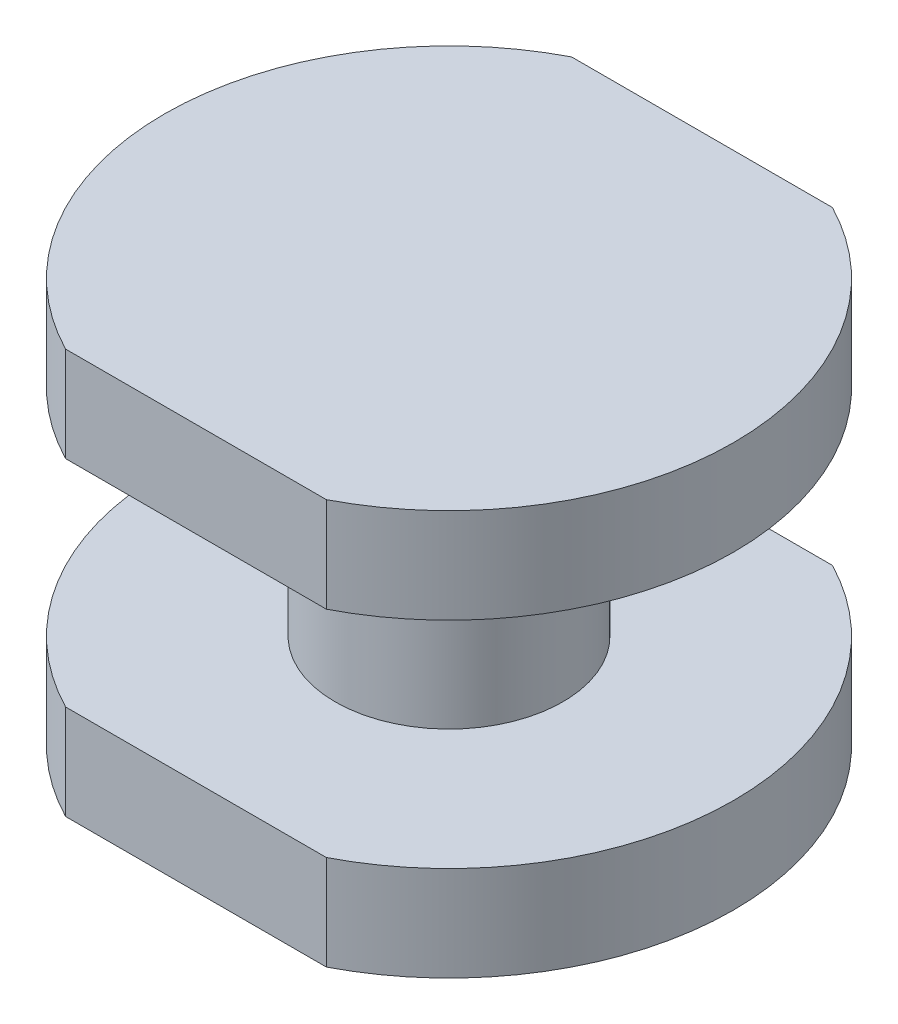
ISO-10303-21;
HEADER;
FILE_DESCRIPTION(('STEP AP214'),'2;1');
FILE_NAME('part.step','',(''),(''),'','','');
FILE_SCHEMA(('AUTOMOTIVE_DESIGN { 1 0 10303 214 1 1 1 1 }'));
ENDSEC;
DATA;
#1=APPLICATION_CONTEXT('core data for automotive mechanical design processes');
#2=APPLICATION_PROTOCOL_DEFINITION('international standard','automotive_design',2000,#1);
#3=PRODUCT_CONTEXT('',#1,'mechanical');
#4=PRODUCT('Part','Part','',(#3));
#5=PRODUCT_RELATED_PRODUCT_CATEGORY('part','',(#4));
#6=PRODUCT_DEFINITION_FORMATION('','',#4);
#7=PRODUCT_DEFINITION_CONTEXT('part definition',#1,'design');
#8=PRODUCT_DEFINITION('design','',#6,#7);
#9=PRODUCT_DEFINITION_SHAPE('','',#8);
#10=(LENGTH_UNIT() NAMED_UNIT(*) SI_UNIT(.MILLI.,.METRE.));
#11=(NAMED_UNIT(*) PLANE_ANGLE_UNIT() SI_UNIT($,.RADIAN.));
#12=(NAMED_UNIT(*) SI_UNIT($,.STERADIAN.) SOLID_ANGLE_UNIT());
#13=UNCERTAINTY_MEASURE_WITH_UNIT(LENGTH_MEASURE(1.E-05),#10,'distance_accuracy_value','');
#14=(GEOMETRIC_REPRESENTATION_CONTEXT(3) GLOBAL_UNCERTAINTY_ASSIGNED_CONTEXT((#13)) GLOBAL_UNIT_ASSIGNED_CONTEXT((#10,
#11,#12)) REPRESENTATION_CONTEXT('',''));
#15=CARTESIAN_POINT('',(0.,0.,0.));
#16=DIRECTION('',(0.,0.,1.));
#17=DIRECTION('',(1.,0.,0.));
#18=AXIS2_PLACEMENT_3D('',#15,#16,#17);
#19=CARTESIAN_POINT('',(0.,0.75,0.));
#20=DIRECTION('',(0.,-1.,0.));
#21=DIRECTION('',(0.,0.,-1.));
#22=AXIS2_PLACEMENT_3D('',#19,#20,#21);
#23=CYLINDRICAL_SURFACE('',#22,2.25);
#24=CARTESIAN_POINT('',(0.,0.,0.));
#25=DIRECTION('',(0.,1.,0.));
#26=DIRECTION('',(0.,0.,1.));
#27=AXIS2_PLACEMENT_3D('',#24,#25,#26);
#28=CIRCLE('',#27,2.25);
#29=CARTESIAN_POINT('',(1.03077640640441,0.,2.));
#30=VERTEX_POINT('',#29);
#31=CARTESIAN_POINT('',(1.03077640640442,0.,-2.));
#32=VERTEX_POINT('',#31);
#33=EDGE_CURVE('E152',#30,#32,#28,.T.);
#34=ORIENTED_EDGE('',*,*,#33,.T.);
#35=DIRECTION('',(0.,-1.,0.));
#36=VECTOR('',#35,1.);
#37=CARTESIAN_POINT('',(1.03077640640442,0.75,-2.));
#38=LINE('',#37,#36);
#39=CARTESIAN_POINT('',(1.03077640640442,0.75,-2.));
#40=VERTEX_POINT('',#39);
#41=EDGE_CURVE('E45',#40,#32,#38,.T.);
#42=ORIENTED_EDGE('',*,*,#41,.F.);
#43=CARTESIAN_POINT('',(0.,0.75,0.));
#44=DIRECTION('',(0.,1.,0.));
#45=DIRECTION('',(0.,0.,1.));
#46=AXIS2_PLACEMENT_3D('',#43,#44,#45);
#47=CIRCLE('',#46,2.25);
#48=CARTESIAN_POINT('',(1.03077640640441,0.75,2.));
#49=VERTEX_POINT('',#48);
#50=EDGE_CURVE('E158',#49,#40,#47,.T.);
#51=ORIENTED_EDGE('',*,*,#50,.F.);
#52=DIRECTION('',(0.,-1.,0.));
#53=VECTOR('',#52,1.);
#54=CARTESIAN_POINT('',(1.03077640640441,0.75,2.));
#55=LINE('',#54,#53);
#56=EDGE_CURVE('E168',#49,#30,#55,.T.);
#57=ORIENTED_EDGE('',*,*,#56,.T.);
#58=EDGE_LOOP('',(#34,#42,#51,#57));
#59=FACE_BOUND('',#58,.T.);
#60=ADVANCED_FACE('F42',(#59),#23,.T.);
#61=CARTESIAN_POINT('',(-1.03077640640442,0.75,-2.));
#62=DIRECTION('',(0.,0.,1.));
#63=DIRECTION('',(1.,0.,0.));
#64=AXIS2_PLACEMENT_3D('',#61,#62,#63);
#65=PLANE('',#64);
#66=DIRECTION('',(-1.,0.,0.));
#67=VECTOR('',#66,1.);
#68=CARTESIAN_POINT('',(-1.03077640640442,0.,-2.));
#69=LINE('',#68,#67);
#70=CARTESIAN_POINT('',(-1.03077640640442,0.,-2.));
#71=VERTEX_POINT('',#70);
#72=EDGE_CURVE('E172',#32,#71,#69,.T.);
#73=ORIENTED_EDGE('',*,*,#72,.T.);
#74=DIRECTION('',(0.,-1.,0.));
#75=VECTOR('',#74,1.);
#76=CARTESIAN_POINT('',(-1.03077640640442,0.75,-2.));
#77=LINE('',#76,#75);
#78=CARTESIAN_POINT('',(-1.03077640640442,0.75,-2.));
#79=VERTEX_POINT('',#78);
#80=EDGE_CURVE('E183',#79,#71,#77,.T.);
#81=ORIENTED_EDGE('',*,*,#80,.F.);
#82=DIRECTION('',(-1.,0.,0.));
#83=VECTOR('',#82,1.);
#84=CARTESIAN_POINT('',(-1.03077640640442,0.75,-2.));
#85=LINE('',#84,#83);
#86=EDGE_CURVE('E92',#40,#79,#85,.T.);
#87=ORIENTED_EDGE('',*,*,#86,.F.);
#88=ORIENTED_EDGE('',*,*,#41,.T.);
#89=EDGE_LOOP('',(#73,#81,#87,#88));
#90=FACE_BOUND('',#89,.T.);
#91=ADVANCED_FACE('F188',(#90),#65,.F.);
#92=CARTESIAN_POINT('',(0.,0.75,0.));
#93=DIRECTION('',(0.,-1.,0.));
#94=DIRECTION('',(0.,0.,-1.));
#95=AXIS2_PLACEMENT_3D('',#92,#93,#94);
#96=CYLINDRICAL_SURFACE('',#95,2.25);
#97=CARTESIAN_POINT('',(0.,0.,0.));
#98=DIRECTION('',(0.,1.,0.));
#99=DIRECTION('',(0.,0.,1.));
#100=AXIS2_PLACEMENT_3D('',#97,#98,#99);
#101=CIRCLE('',#100,2.25);
#102=CARTESIAN_POINT('',(-1.03077640640441,0.,2.));
#103=VERTEX_POINT('',#102);
#104=EDGE_CURVE('E78',#71,#103,#101,.T.);
#105=ORIENTED_EDGE('',*,*,#104,.T.);
#106=DIRECTION('',(0.,-1.,0.));
#107=VECTOR('',#106,1.);
#108=CARTESIAN_POINT('',(-1.03077640640441,0.75,2.));
#109=LINE('',#108,#107);
#110=CARTESIAN_POINT('',(-1.03077640640441,0.75,2.));
#111=VERTEX_POINT('',#110);
#112=EDGE_CURVE('E181',#111,#103,#109,.T.);
#113=ORIENTED_EDGE('',*,*,#112,.F.);
#114=CARTESIAN_POINT('',(0.,0.75,0.));
#115=DIRECTION('',(0.,1.,0.));
#116=DIRECTION('',(0.,0.,1.));
#117=AXIS2_PLACEMENT_3D('',#114,#115,#116);
#118=CIRCLE('',#117,2.25);
#119=EDGE_CURVE('E163',#79,#111,#118,.T.);
#120=ORIENTED_EDGE('',*,*,#119,.F.);
#121=ORIENTED_EDGE('',*,*,#80,.T.);
#122=EDGE_LOOP('',(#105,#113,#120,#121));
#123=FACE_BOUND('',#122,.T.);
#124=ADVANCED_FACE('F212',(#123),#96,.T.);
#125=CARTESIAN_POINT('',(-1.03077640640441,0.75,2.));
#126=DIRECTION('',(0.,0.,-1.));
#127=DIRECTION('',(-1.,0.,0.));
#128=AXIS2_PLACEMENT_3D('',#125,#126,#127);
#129=PLANE('',#128);
#130=DIRECTION('',(1.,0.,0.));
#131=VECTOR('',#130,1.);
#132=CARTESIAN_POINT('',(-1.03077640640441,0.,2.));
#133=LINE('',#132,#131);
#134=EDGE_CURVE('E84',#103,#30,#133,.T.);
#135=ORIENTED_EDGE('',*,*,#134,.T.);
#136=ORIENTED_EDGE('',*,*,#56,.F.);
#137=DIRECTION('',(1.,0.,0.));
#138=VECTOR('',#137,1.);
#139=CARTESIAN_POINT('',(-1.03077640640441,0.75,2.));
#140=LINE('',#139,#138);
#141=EDGE_CURVE('E60',#111,#49,#140,.T.);
#142=ORIENTED_EDGE('',*,*,#141,.F.);
#143=ORIENTED_EDGE('',*,*,#112,.T.);
#144=EDGE_LOOP('',(#135,#136,#142,#143));
#145=FACE_BOUND('',#144,.T.);
#146=ADVANCED_FACE('F204',(#145),#129,.F.);
#147=CARTESIAN_POINT('',(0.,0.75,0.));
#148=DIRECTION('',(0.,1.,0.));
#149=DIRECTION('',(0.,0.,1.));
#150=AXIS2_PLACEMENT_3D('',#147,#148,#149);
#151=PLANE('',#150);
#152=CARTESIAN_POINT('',(0.,0.75,0.));
#153=DIRECTION('',(0.,1.,0.));
#154=DIRECTION('',(0.,0.,1.));
#155=AXIS2_PLACEMENT_3D('',#152,#153,#154);
#156=CIRCLE('',#155,0.9);
#157=CARTESIAN_POINT('',(0.,0.75,0.9));
#158=VERTEX_POINT('',#157);
#159=EDGE_CURVE('E11',#158,#158,#156,.T.);
#160=ORIENTED_EDGE('',*,*,#159,.F.);
#161=EDGE_LOOP('',(#160));
#162=FACE_BOUND('',#161,.T.);
#163=ORIENTED_EDGE('',*,*,#50,.T.);
#164=ORIENTED_EDGE('',*,*,#86,.T.);
#165=ORIENTED_EDGE('',*,*,#119,.T.);
#166=ORIENTED_EDGE('',*,*,#141,.T.);
#167=EDGE_LOOP('',(#163,#164,#165,#166));
#168=FACE_BOUND('',#167,.T.);
#169=ADVANCED_FACE('F196',(#162,#168),#151,.T.);
#170=CARTESIAN_POINT('',(0.,0.,0.));
#171=DIRECTION('',(0.,1.,0.));
#172=DIRECTION('',(0.,0.,1.));
#173=AXIS2_PLACEMENT_3D('',#170,#171,#172);
#174=PLANE('',#173);
#175=ORIENTED_EDGE('',*,*,#33,.F.);
#176=ORIENTED_EDGE('',*,*,#134,.F.);
#177=ORIENTED_EDGE('',*,*,#104,.F.);
#178=ORIENTED_EDGE('',*,*,#72,.F.);
#179=EDGE_LOOP('',(#175,#176,#177,#178));
#180=FACE_BOUND('',#179,.T.);
#181=ADVANCED_FACE('F193',(#180),#174,.F.);
#182=CARTESIAN_POINT('',(0.,2.45,0.));
#183=DIRECTION('',(0.,-1.,0.));
#184=DIRECTION('',(0.,0.,-1.));
#185=AXIS2_PLACEMENT_3D('',#182,#183,#184);
#186=CYLINDRICAL_SURFACE('',#185,0.9);
#187=CARTESIAN_POINT('',(0.,2.45,0.));
#188=DIRECTION('',(0.,1.,0.));
#189=DIRECTION('',(0.,0.,1.));
#190=AXIS2_PLACEMENT_3D('',#187,#188,#189);
#191=CIRCLE('',#190,0.9);
#192=CARTESIAN_POINT('',(0.,2.45,0.9));
#193=VERTEX_POINT('',#192);
#194=EDGE_CURVE('E147',#193,#193,#191,.T.);
#195=ORIENTED_EDGE('',*,*,#194,.F.);
#196=EDGE_LOOP('',(#195));
#197=FACE_BOUND('',#196,.T.);
#198=ORIENTED_EDGE('',*,*,#159,.T.);
#199=EDGE_LOOP('',(#198));
#200=FACE_BOUND('',#199,.T.);
#201=ADVANCED_FACE('F195',(#197,#200),#186,.T.);
#202=CARTESIAN_POINT('',(0.,3.2,0.));
#203=DIRECTION('',(0.,-1.,0.));
#204=DIRECTION('',(0.,0.,-1.));
#205=AXIS2_PLACEMENT_3D('',#202,#203,#204);
#206=CYLINDRICAL_SURFACE('',#205,2.25);
#207=CARTESIAN_POINT('',(0.,2.45,0.));
#208=DIRECTION('',(0.,1.,0.));
#209=DIRECTION('',(0.,0.,1.));
#210=AXIS2_PLACEMENT_3D('',#207,#208,#209);
#211=CIRCLE('',#210,2.25);
#212=CARTESIAN_POINT('',(-1.03077640640442,2.45,-2.));
#213=VERTEX_POINT('',#212);
#214=CARTESIAN_POINT('',(-1.03077640640441,2.45,2.));
#215=VERTEX_POINT('',#214);
#216=EDGE_CURVE('E145',#213,#215,#211,.T.);
#217=ORIENTED_EDGE('',*,*,#216,.T.);
#218=DIRECTION('',(0.,-1.,0.));
#219=VECTOR('',#218,1.);
#220=CARTESIAN_POINT('',(-1.03077640640441,3.2,2.));
#221=LINE('',#220,#219);
#222=CARTESIAN_POINT('',(-1.03077640640441,3.2,2.));
#223=VERTEX_POINT('',#222);
#224=EDGE_CURVE('E123',#223,#215,#221,.T.);
#225=ORIENTED_EDGE('',*,*,#224,.F.);
#226=CARTESIAN_POINT('',(0.,3.2,0.));
#227=DIRECTION('',(0.,1.,0.));
#228=DIRECTION('',(0.,0.,1.));
#229=AXIS2_PLACEMENT_3D('',#226,#227,#228);
#230=CIRCLE('',#229,2.25);
#231=CARTESIAN_POINT('',(-1.03077640640442,3.2,-2.));
#232=VERTEX_POINT('',#231);
#233=EDGE_CURVE('E131',#232,#223,#230,.T.);
#234=ORIENTED_EDGE('',*,*,#233,.F.);
#235=DIRECTION('',(0.,-1.,0.));
#236=VECTOR('',#235,1.);
#237=CARTESIAN_POINT('',(-1.03077640640442,3.2,-2.));
#238=LINE('',#237,#236);
#239=EDGE_CURVE('E351',#232,#213,#238,.T.);
#240=ORIENTED_EDGE('',*,*,#239,.T.);
#241=EDGE_LOOP('',(#217,#225,#234,#240));
#242=FACE_BOUND('',#241,.T.);
#243=ADVANCED_FACE('F143',(#242),#206,.T.);
#244=CARTESIAN_POINT('',(-1.03077640640441,3.2,2.));
#245=DIRECTION('',(0.,0.,-1.));
#246=DIRECTION('',(-1.,0.,0.));
#247=AXIS2_PLACEMENT_3D('',#244,#245,#246);
#248=PLANE('',#247);
#249=DIRECTION('',(1.,0.,0.));
#250=VECTOR('',#249,1.);
#251=CARTESIAN_POINT('',(-1.03077640640441,2.45,2.));
#252=LINE('',#251,#250);
#253=CARTESIAN_POINT('',(1.03077640640441,2.45,2.));
#254=VERTEX_POINT('',#253);
#255=EDGE_CURVE('E338',#215,#254,#252,.T.);
#256=ORIENTED_EDGE('',*,*,#255,.T.);
#257=DIRECTION('',(0.,-1.,0.));
#258=VECTOR('',#257,1.);
#259=CARTESIAN_POINT('',(1.03077640640441,3.2,2.));
#260=LINE('',#259,#258);
#261=CARTESIAN_POINT('',(1.03077640640441,3.2,2.));
#262=VERTEX_POINT('',#261);
#263=EDGE_CURVE('E126',#262,#254,#260,.T.);
#264=ORIENTED_EDGE('',*,*,#263,.F.);
#265=DIRECTION('',(1.,0.,0.));
#266=VECTOR('',#265,1.);
#267=CARTESIAN_POINT('',(-1.03077640640441,3.2,2.));
#268=LINE('',#267,#266);
#269=EDGE_CURVE('E119',#223,#262,#268,.T.);
#270=ORIENTED_EDGE('',*,*,#269,.F.);
#271=ORIENTED_EDGE('',*,*,#224,.T.);
#272=EDGE_LOOP('',(#256,#264,#270,#271));
#273=FACE_BOUND('',#272,.T.);
#274=ADVANCED_FACE('F121',(#273),#248,.F.);
#275=CARTESIAN_POINT('',(0.,3.2,0.));
#276=DIRECTION('',(0.,-1.,0.));
#277=DIRECTION('',(0.,0.,-1.));
#278=AXIS2_PLACEMENT_3D('',#275,#276,#277);
#279=CYLINDRICAL_SURFACE('',#278,2.25);
#280=CARTESIAN_POINT('',(0.,2.45,0.));
#281=DIRECTION('',(0.,1.,0.));
#282=DIRECTION('',(0.,0.,1.));
#283=AXIS2_PLACEMENT_3D('',#280,#281,#282);
#284=CIRCLE('',#283,2.25);
#285=CARTESIAN_POINT('',(1.03077640640442,2.45,-2.));
#286=VERTEX_POINT('',#285);
#287=EDGE_CURVE('E342',#254,#286,#284,.T.);
#288=ORIENTED_EDGE('',*,*,#287,.T.);
#289=DIRECTION('',(0.,-1.,0.));
#290=VECTOR('',#289,1.);
#291=CARTESIAN_POINT('',(1.03077640640442,3.2,-2.));
#292=LINE('',#291,#290);
#293=CARTESIAN_POINT('',(1.03077640640442,3.2,-2.));
#294=VERTEX_POINT('',#293);
#295=EDGE_CURVE('E154',#294,#286,#292,.T.);
#296=ORIENTED_EDGE('',*,*,#295,.F.);
#297=CARTESIAN_POINT('',(0.,3.2,0.));
#298=DIRECTION('',(0.,1.,0.));
#299=DIRECTION('',(0.,0.,1.));
#300=AXIS2_PLACEMENT_3D('',#297,#298,#299);
#301=CIRCLE('',#300,2.25);
#302=EDGE_CURVE('E130',#262,#294,#301,.T.);
#303=ORIENTED_EDGE('',*,*,#302,.F.);
#304=ORIENTED_EDGE('',*,*,#263,.T.);
#305=EDGE_LOOP('',(#288,#296,#303,#304));
#306=FACE_BOUND('',#305,.T.);
#307=ADVANCED_FACE('F254',(#306),#279,.T.);
#308=CARTESIAN_POINT('',(-1.03077640640442,3.2,-2.));
#309=DIRECTION('',(0.,0.,1.));
#310=DIRECTION('',(1.,0.,0.));
#311=AXIS2_PLACEMENT_3D('',#308,#309,#310);
#312=PLANE('',#311);
#313=DIRECTION('',(-1.,0.,0.));
#314=VECTOR('',#313,1.);
#315=CARTESIAN_POINT('',(-1.03077640640442,2.45,-2.));
#316=LINE('',#315,#314);
#317=EDGE_CURVE('E141',#286,#213,#316,.T.);
#318=ORIENTED_EDGE('',*,*,#317,.T.);
#319=ORIENTED_EDGE('',*,*,#239,.F.);
#320=DIRECTION('',(-1.,0.,0.));
#321=VECTOR('',#320,1.);
#322=CARTESIAN_POINT('',(-1.03077640640442,3.2,-2.));
#323=LINE('',#322,#321);
#324=EDGE_CURVE('E136',#294,#232,#323,.T.);
#325=ORIENTED_EDGE('',*,*,#324,.F.);
#326=ORIENTED_EDGE('',*,*,#295,.T.);
#327=EDGE_LOOP('',(#318,#319,#325,#326));
#328=FACE_BOUND('',#327,.T.);
#329=ADVANCED_FACE('F264',(#328),#312,.F.);
#330=CARTESIAN_POINT('',(0.,3.2,0.));
#331=DIRECTION('',(0.,1.,0.));
#332=DIRECTION('',(0.,0.,1.));
#333=AXIS2_PLACEMENT_3D('',#330,#331,#332);
#334=PLANE('',#333);
#335=ORIENTED_EDGE('',*,*,#233,.T.);
#336=ORIENTED_EDGE('',*,*,#269,.T.);
#337=ORIENTED_EDGE('',*,*,#302,.T.);
#338=ORIENTED_EDGE('',*,*,#324,.T.);
#339=EDGE_LOOP('',(#335,#336,#337,#338));
#340=FACE_BOUND('',#339,.T.);
#341=ADVANCED_FACE('F134',(#340),#334,.T.);
#342=CARTESIAN_POINT('',(0.,2.45,0.));
#343=DIRECTION('',(0.,1.,0.));
#344=DIRECTION('',(0.,0.,1.));
#345=AXIS2_PLACEMENT_3D('',#342,#343,#344);
#346=PLANE('',#345);
#347=ORIENTED_EDGE('',*,*,#194,.T.);
#348=EDGE_LOOP('',(#347));
#349=FACE_BOUND('',#348,.T.);
#350=ORIENTED_EDGE('',*,*,#216,.F.);
#351=ORIENTED_EDGE('',*,*,#317,.F.);
#352=ORIENTED_EDGE('',*,*,#287,.F.);
#353=ORIENTED_EDGE('',*,*,#255,.F.);
#354=EDGE_LOOP('',(#350,#351,#352,#353));
#355=FACE_BOUND('',#354,.T.);
#356=ADVANCED_FACE('F285',(#349,#355),#346,.F.);
#357=CLOSED_SHELL('',(#60,#91,#124,#146,#169,#181,#201,#243,#274,#307,#329,#341,#356));
#358=MANIFOLD_SOLID_BREP('B2',#357);
#359=ADVANCED_BREP_SHAPE_REPRESENTATION('',(#18,#358),#14);
#360=SHAPE_DEFINITION_REPRESENTATION(#9,#359);
ENDSEC;
END-ISO-10303-21;
